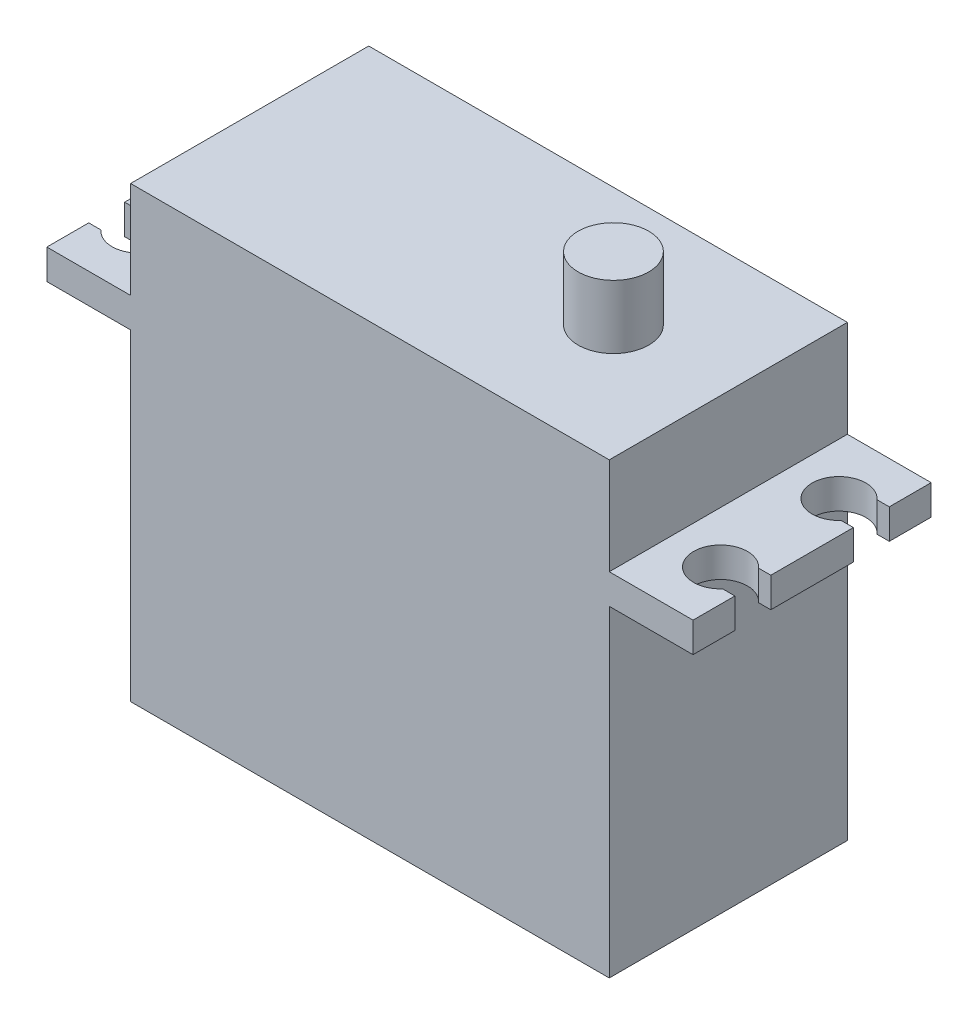
ISO-10303-21;
HEADER;
FILE_DESCRIPTION(('STEP AP214'),'2;1');
FILE_NAME('part.step','',(''),(''),'','','');
FILE_SCHEMA(('AUTOMOTIVE_DESIGN { 1 0 10303 214 1 1 1 1 }'));
ENDSEC;
DATA;
#1=APPLICATION_CONTEXT('core data for automotive mechanical design processes');
#2=APPLICATION_PROTOCOL_DEFINITION('international standard','automotive_design',2000,#1);
#3=PRODUCT_CONTEXT('',#1,'mechanical');
#4=PRODUCT('Part','Part','',(#3));
#5=PRODUCT_RELATED_PRODUCT_CATEGORY('part','',(#4));
#6=PRODUCT_DEFINITION_FORMATION('','',#4);
#7=PRODUCT_DEFINITION_CONTEXT('part definition',#1,'design');
#8=PRODUCT_DEFINITION('design','',#6,#7);
#9=PRODUCT_DEFINITION_SHAPE('','',#8);
#10=(LENGTH_UNIT() NAMED_UNIT(*) SI_UNIT(.MILLI.,.METRE.));
#11=(NAMED_UNIT(*) PLANE_ANGLE_UNIT() SI_UNIT($,.RADIAN.));
#12=(NAMED_UNIT(*) SI_UNIT($,.STERADIAN.) SOLID_ANGLE_UNIT());
#13=UNCERTAINTY_MEASURE_WITH_UNIT(LENGTH_MEASURE(1.E-05),#10,'distance_accuracy_value','');
#14=(GEOMETRIC_REPRESENTATION_CONTEXT(3) GLOBAL_UNCERTAINTY_ASSIGNED_CONTEXT((#13)) GLOBAL_UNIT_ASSIGNED_CONTEXT((#10,
#11,#12)) REPRESENTATION_CONTEXT('',''));
#15=CARTESIAN_POINT('',(0.,0.,0.));
#16=DIRECTION('',(0.,0.,1.));
#17=DIRECTION('',(1.,0.,0.));
#18=AXIS2_PLACEMENT_3D('',#15,#16,#17);
#19=CARTESIAN_POINT('',(10.4,42.8,0.));
#20=DIRECTION('',(0.,-1.,0.));
#21=DIRECTION('',(1.,0.,0.));
#22=AXIS2_PLACEMENT_3D('',#19,#20,#21);
#23=PLANE('',#22);
#24=CARTESIAN_POINT('',(10.4,42.8,0.));
#25=DIRECTION('',(0.,1.,0.));
#26=DIRECTION('',(-1.,0.,0.));
#27=AXIS2_PLACEMENT_3D('',#24,#25,#26);
#28=CIRCLE('',#27,2.95);
#29=CARTESIAN_POINT('',(7.45,42.8,0.));
#30=VERTEX_POINT('',#29);
#31=EDGE_CURVE('E11',#30,#30,#28,.T.);
#32=ORIENTED_EDGE('',*,*,#31,.T.);
#33=EDGE_LOOP('',(#32));
#34=FACE_BOUND('',#33,.T.);
#35=ADVANCED_FACE('F51',(#34),#23,.F.);
#36=CARTESIAN_POINT('',(10.4,42.8,0.));
#37=DIRECTION('',(0.,1.,0.));
#38=DIRECTION('',(-1.,0.,0.));
#39=AXIS2_PLACEMENT_3D('',#36,#37,#38);
#40=CYLINDRICAL_SURFACE('',#39,2.95);
#41=ORIENTED_EDGE('',*,*,#31,.F.);
#42=EDGE_LOOP('',(#41));
#43=FACE_BOUND('',#42,.T.);
#44=CARTESIAN_POINT('',(10.4,25.,0.));
#45=DIRECTION('',(0.,1.,0.));
#46=DIRECTION('',(-1.,0.,0.));
#47=AXIS2_PLACEMENT_3D('',#44,#45,#46);
#48=CIRCLE('',#47,2.95);
#49=CARTESIAN_POINT('',(7.45,25.,0.));
#50=VERTEX_POINT('',#49);
#51=EDGE_CURVE('E57',#50,#50,#48,.T.);
#52=ORIENTED_EDGE('',*,*,#51,.T.);
#53=EDGE_LOOP('',(#52));
#54=FACE_BOUND('',#53,.T.);
#55=ADVANCED_FACE('F83',(#43,#54),#40,.T.);
#56=CARTESIAN_POINT('',(13.35,25.,0.));
#57=DIRECTION('',(0.,-1.,0.));
#58=DIRECTION('',(1.,0.,0.));
#59=AXIS2_PLACEMENT_3D('',#56,#57,#58);
#60=PLANE('',#59);
#61=ORIENTED_EDGE('',*,*,#51,.F.);
#62=EDGE_LOOP('',(#61));
#63=FACE_BOUND('',#62,.T.);
#64=CARTESIAN_POINT('',(10.4,25.,0.));
#65=DIRECTION('',(0.,1.,0.));
#66=DIRECTION('',(-1.,0.,0.));
#67=AXIS2_PLACEMENT_3D('',#64,#65,#66);
#68=CIRCLE('',#67,6.);
#69=CARTESIAN_POINT('',(4.4,25.,0.));
#70=VERTEX_POINT('',#69);
#71=EDGE_CURVE('E61',#70,#70,#68,.T.);
#72=ORIENTED_EDGE('',*,*,#71,.T.);
#73=EDGE_LOOP('',(#72));
#74=FACE_BOUND('',#73,.T.);
#75=ADVANCED_FACE('F79',(#63,#74),#60,.F.);
#76=CARTESIAN_POINT('',(10.4,42.8,0.));
#77=DIRECTION('',(0.,1.,0.));
#78=DIRECTION('',(-1.,0.,0.));
#79=AXIS2_PLACEMENT_3D('',#76,#77,#78);
#80=CYLINDRICAL_SURFACE('',#79,6.);
#81=ORIENTED_EDGE('',*,*,#71,.F.);
#82=EDGE_LOOP('',(#81));
#83=FACE_BOUND('',#82,.T.);
#84=CARTESIAN_POINT('',(10.4,3.,0.));
#85=DIRECTION('',(0.,1.,0.));
#86=DIRECTION('',(-1.,0.,0.));
#87=AXIS2_PLACEMENT_3D('',#84,#85,#86);
#88=CIRCLE('',#87,6.);
#89=CARTESIAN_POINT('',(4.4,3.,0.));
#90=VERTEX_POINT('',#89);
#91=EDGE_CURVE('E65',#90,#90,#88,.T.);
#92=ORIENTED_EDGE('',*,*,#91,.T.);
#93=EDGE_LOOP('',(#92));
#94=FACE_BOUND('',#93,.T.);
#95=ADVANCED_FACE('F71',(#83,#94),#80,.T.);
#96=CARTESIAN_POINT('',(16.4,3.,0.));
#97=DIRECTION('',(0.,1.,0.));
#98=DIRECTION('',(-1.,0.,0.));
#99=AXIS2_PLACEMENT_3D('',#96,#97,#98);
#100=PLANE('',#99);
#101=ORIENTED_EDGE('',*,*,#91,.F.);
#102=EDGE_LOOP('',(#101));
#103=FACE_BOUND('',#102,.T.);
#104=ADVANCED_FACE('F73',(#103),#100,.F.);
#105=CLOSED_SHELL('',(#35,#55,#75,#95,#104));
#106=MANIFOLD_SOLID_BREP('B2',#105);
#107=CARTESIAN_POINT('',(-24.3,29.4,-4.95));
#108=DIRECTION('',(0.,1.,0.));
#109=DIRECTION('',(0.,0.,1.));
#110=AXIS2_PLACEMENT_3D('',#107,#108,#109);
#111=PLANE('',#110);
#112=DIRECTION('',(0.,0.,-1.));
#113=VECTOR('',#112,1.);
#114=CARTESIAN_POINT('',(20.,29.4,9.95));
#115=LINE('',#114,#113);
#116=CARTESIAN_POINT('',(20.,29.4,9.95));
#117=VERTEX_POINT('',#116);
#118=CARTESIAN_POINT('',(20.,29.4,-9.95));
#119=VERTEX_POINT('',#118);
#120=EDGE_CURVE('E128',#117,#119,#115,.T.);
#121=ORIENTED_EDGE('',*,*,#120,.F.);
#122=DIRECTION('',(1.,0.,0.));
#123=VECTOR('',#122,1.);
#124=CARTESIAN_POINT('',(-27.,29.4,9.95));
#125=LINE('',#124,#123);
#126=CARTESIAN_POINT('',(27.,29.4,9.95));
#127=VERTEX_POINT('',#126);
#128=EDGE_CURVE('E353',#117,#127,#125,.T.);
#129=ORIENTED_EDGE('',*,*,#128,.T.);
#130=DIRECTION('',(0.,0.,-1.));
#131=VECTOR('',#130,1.);
#132=CARTESIAN_POINT('',(27.,29.4,9.95));
#133=LINE('',#132,#131);
#134=CARTESIAN_POINT('',(27.,29.4,6.45));
#135=VERTEX_POINT('',#134);
#136=EDGE_CURVE('E356',#127,#135,#133,.T.);
#137=ORIENTED_EDGE('',*,*,#136,.T.);
#138=DIRECTION('',(-1.,0.,0.));
#139=VECTOR('',#138,1.);
#140=CARTESIAN_POINT('',(25.9770509831248,29.4,6.45));
#141=LINE('',#140,#139);
#142=CARTESIAN_POINT('',(25.9770509831248,29.4,6.45));
#143=VERTEX_POINT('',#142);
#144=EDGE_CURVE('E358',#135,#143,#141,.T.);
#145=ORIENTED_EDGE('',*,*,#144,.T.);
#146=CARTESIAN_POINT('',(24.3,29.4,4.95));
#147=DIRECTION('',(0.,-1.,0.));
#148=DIRECTION('',(0.,0.,1.));
#149=AXIS2_PLACEMENT_3D('',#146,#147,#148);
#150=CIRCLE('',#149,2.25);
#151=CARTESIAN_POINT('',(25.9770509831248,29.4,3.45));
#152=VERTEX_POINT('',#151);
#153=EDGE_CURVE('E360',#143,#152,#150,.T.);
#154=ORIENTED_EDGE('',*,*,#153,.T.);
#155=DIRECTION('',(1.,0.,0.));
#156=VECTOR('',#155,1.);
#157=CARTESIAN_POINT('',(25.9770509831248,29.4,3.45));
#158=LINE('',#157,#156);
#159=CARTESIAN_POINT('',(27.,29.4,3.45));
#160=VERTEX_POINT('',#159);
#161=EDGE_CURVE('E362',#152,#160,#158,.T.);
#162=ORIENTED_EDGE('',*,*,#161,.T.);
#163=DIRECTION('',(0.,0.,-1.));
#164=VECTOR('',#163,1.);
#165=CARTESIAN_POINT('',(27.,29.4,3.45));
#166=LINE('',#165,#164);
#167=CARTESIAN_POINT('',(27.,29.4,-3.45));
#168=VERTEX_POINT('',#167);
#169=EDGE_CURVE('E364',#160,#168,#166,.T.);
#170=ORIENTED_EDGE('',*,*,#169,.T.);
#171=DIRECTION('',(-1.,0.,0.));
#172=VECTOR('',#171,1.);
#173=CARTESIAN_POINT('',(25.9770509831248,29.4,-3.45));
#174=LINE('',#173,#172);
#175=CARTESIAN_POINT('',(25.9770509831248,29.4,-3.45));
#176=VERTEX_POINT('',#175);
#177=EDGE_CURVE('E366',#168,#176,#174,.T.);
#178=ORIENTED_EDGE('',*,*,#177,.T.);
#179=CARTESIAN_POINT('',(24.3,29.4,-4.95));
#180=DIRECTION('',(0.,-1.,0.));
#181=DIRECTION('',(0.,0.,1.));
#182=AXIS2_PLACEMENT_3D('',#179,#180,#181);
#183=CIRCLE('',#182,2.25);
#184=CARTESIAN_POINT('',(25.9770509831248,29.4,-6.45));
#185=VERTEX_POINT('',#184);
#186=EDGE_CURVE('E368',#176,#185,#183,.T.);
#187=ORIENTED_EDGE('',*,*,#186,.T.);
#188=DIRECTION('',(1.,0.,0.));
#189=VECTOR('',#188,1.);
#190=CARTESIAN_POINT('',(25.9770509831248,29.4,-6.45));
#191=LINE('',#190,#189);
#192=CARTESIAN_POINT('',(27.,29.4,-6.45));
#193=VERTEX_POINT('',#192);
#194=EDGE_CURVE('E370',#185,#193,#191,.T.);
#195=ORIENTED_EDGE('',*,*,#194,.T.);
#196=DIRECTION('',(0.,0.,-1.));
#197=VECTOR('',#196,1.);
#198=CARTESIAN_POINT('',(27.,29.4,-6.45));
#199=LINE('',#198,#197);
#200=CARTESIAN_POINT('',(27.,29.4,-9.95));
#201=VERTEX_POINT('',#200);
#202=EDGE_CURVE('E328',#193,#201,#199,.T.);
#203=ORIENTED_EDGE('',*,*,#202,.T.);
#204=DIRECTION('',(-1.,0.,0.));
#205=VECTOR('',#204,1.);
#206=CARTESIAN_POINT('',(-27.,29.4,-9.95));
#207=LINE('',#206,#205);
#208=EDGE_CURVE('E333',#201,#119,#207,.T.);
#209=ORIENTED_EDGE('',*,*,#208,.T.);
#210=EDGE_LOOP('',(#121,#129,#137,#145,#154,#162,#170,#178,#187,#195,#203,#209));
#211=FACE_BOUND('',#210,.T.);
#212=ADVANCED_FACE('F112',(#211),#111,.T.);
#213=CARTESIAN_POINT('',(20.,26.9,9.95));
#214=DIRECTION('',(-1.,0.,0.));
#215=DIRECTION('',(0.,0.,1.));
#216=AXIS2_PLACEMENT_3D('',#213,#214,#215);
#217=PLANE('',#216);
#218=DIRECTION('',(0.,0.,-1.));
#219=VECTOR('',#218,1.);
#220=CARTESIAN_POINT('',(20.,0.,9.95));
#221=LINE('',#220,#219);
#222=CARTESIAN_POINT('',(20.,0.,9.95));
#223=VERTEX_POINT('',#222);
#224=CARTESIAN_POINT('',(20.,0.,-9.95));
#225=VERTEX_POINT('',#224);
#226=EDGE_CURVE('E472',#223,#225,#221,.T.);
#227=ORIENTED_EDGE('',*,*,#226,.T.);
#228=DIRECTION('',(0.,-1.,0.));
#229=VECTOR('',#228,1.);
#230=CARTESIAN_POINT('',(20.,26.9,-9.95));
#231=LINE('',#230,#229);
#232=CARTESIAN_POINT('',(20.,26.9,-9.95));
#233=VERTEX_POINT('',#232);
#234=EDGE_CURVE('E49',#233,#225,#231,.T.);
#235=ORIENTED_EDGE('',*,*,#234,.F.);
#236=DIRECTION('',(0.,0.,-1.));
#237=VECTOR('',#236,1.);
#238=CARTESIAN_POINT('',(20.,26.9,9.95));
#239=LINE('',#238,#237);
#240=CARTESIAN_POINT('',(20.,26.9,9.95));
#241=VERTEX_POINT('',#240);
#242=EDGE_CURVE('E473',#241,#233,#239,.T.);
#243=ORIENTED_EDGE('',*,*,#242,.F.);
#244=DIRECTION('',(0.,-1.,0.));
#245=VECTOR('',#244,1.);
#246=CARTESIAN_POINT('',(20.,26.9,9.95));
#247=LINE('',#246,#245);
#248=EDGE_CURVE('E480',#241,#223,#247,.T.);
#249=ORIENTED_EDGE('',*,*,#248,.T.);
#250=EDGE_LOOP('',(#227,#235,#243,#249));
#251=FACE_BOUND('',#250,.T.);
#252=ADVANCED_FACE('F114',(#251),#217,.F.);
#253=CARTESIAN_POINT('',(-20.,26.9,-9.95));
#254=DIRECTION('',(0.,0.,1.));
#255=DIRECTION('',(1.,0.,0.));
#256=AXIS2_PLACEMENT_3D('',#253,#254,#255);
#257=PLANE('',#256);
#258=DIRECTION('',(-1.,0.,0.));
#259=VECTOR('',#258,1.);
#260=CARTESIAN_POINT('',(-20.,0.,-9.95));
#261=LINE('',#260,#259);
#262=CARTESIAN_POINT('',(-20.,0.,-9.95));
#263=VERTEX_POINT('',#262);
#264=EDGE_CURVE('E483',#225,#263,#261,.T.);
#265=ORIENTED_EDGE('',*,*,#264,.T.);
#266=DIRECTION('',(0.,-1.,0.));
#267=VECTOR('',#266,1.);
#268=CARTESIAN_POINT('',(-20.,26.9,-9.95));
#269=LINE('',#268,#267);
#270=CARTESIAN_POINT('',(-20.,26.9,-9.95));
#271=VERTEX_POINT('',#270);
#272=EDGE_CURVE('E121',#271,#263,#269,.T.);
#273=ORIENTED_EDGE('',*,*,#272,.F.);
#274=DIRECTION('',(-1.,0.,0.));
#275=VECTOR('',#274,1.);
#276=CARTESIAN_POINT('',(-27.,26.9,-9.95));
#277=LINE('',#276,#275);
#278=CARTESIAN_POINT('',(-27.,26.9,-9.95));
#279=VERTEX_POINT('',#278);
#280=EDGE_CURVE('E322',#271,#279,#277,.T.);
#281=ORIENTED_EDGE('',*,*,#280,.T.);
#282=DIRECTION('',(0.,-1.,0.));
#283=VECTOR('',#282,1.);
#284=CARTESIAN_POINT('',(-27.,29.4,-9.95));
#285=LINE('',#284,#283);
#286=CARTESIAN_POINT('',(-27.,29.4,-9.95));
#287=VERTEX_POINT('',#286);
#288=EDGE_CURVE('E466',#287,#279,#285,.T.);
#289=ORIENTED_EDGE('',*,*,#288,.F.);
#290=CARTESIAN_POINT('',(-20.,29.4,-9.95));
#291=VERTEX_POINT('',#290);
#292=EDGE_CURVE('E331',#291,#287,#207,.T.);
#293=ORIENTED_EDGE('',*,*,#292,.F.);
#294=DIRECTION('',(0.,-1.,0.));
#295=VECTOR('',#294,1.);
#296=CARTESIAN_POINT('',(-20.,37.5,-9.95));
#297=LINE('',#296,#295);
#298=CARTESIAN_POINT('',(-20.,37.5,-9.95));
#299=VERTEX_POINT('',#298);
#300=EDGE_CURVE('E304',#299,#291,#297,.T.);
#301=ORIENTED_EDGE('',*,*,#300,.F.);
#302=DIRECTION('',(-1.,0.,0.));
#303=VECTOR('',#302,1.);
#304=CARTESIAN_POINT('',(-20.,37.5,-9.95));
#305=LINE('',#304,#303);
#306=CARTESIAN_POINT('',(20.,37.5,-9.95));
#307=VERTEX_POINT('',#306);
#308=EDGE_CURVE('E298',#307,#299,#305,.T.);
#309=ORIENTED_EDGE('',*,*,#308,.F.);
#310=DIRECTION('',(0.,-1.,0.));
#311=VECTOR('',#310,1.);
#312=CARTESIAN_POINT('',(20.,37.5,-9.95));
#313=LINE('',#312,#311);
#314=EDGE_CURVE('E302',#307,#119,#313,.T.);
#315=ORIENTED_EDGE('',*,*,#314,.T.);
#316=ORIENTED_EDGE('',*,*,#208,.F.);
#317=DIRECTION('',(0.,-1.,0.));
#318=VECTOR('',#317,1.);
#319=CARTESIAN_POINT('',(27.,29.4,-9.95));
#320=LINE('',#319,#318);
#321=CARTESIAN_POINT('',(27.,26.9,-9.95));
#322=VERTEX_POINT('',#321);
#323=EDGE_CURVE('E469',#201,#322,#320,.T.);
#324=ORIENTED_EDGE('',*,*,#323,.T.);
#325=EDGE_CURVE('E373',#322,#233,#277,.T.);
#326=ORIENTED_EDGE('',*,*,#325,.T.);
#327=ORIENTED_EDGE('',*,*,#234,.T.);
#328=EDGE_LOOP('',(#265,#273,#281,#289,#293,#301,#309,#315,#316,#324,#326,#327));
#329=FACE_BOUND('',#328,.T.);
#330=ADVANCED_FACE('F300',(#329),#257,.F.);
#331=CARTESIAN_POINT('',(-20.,26.9,9.95));
#332=DIRECTION('',(1.,0.,0.));
#333=DIRECTION('',(0.,0.,-1.));
#334=AXIS2_PLACEMENT_3D('',#331,#332,#333);
#335=PLANE('',#334);
#336=DIRECTION('',(0.,0.,1.));
#337=VECTOR('',#336,1.);
#338=CARTESIAN_POINT('',(-20.,0.,9.95));
#339=LINE('',#338,#337);
#340=CARTESIAN_POINT('',(-20.,0.,9.95));
#341=VERTEX_POINT('',#340);
#342=EDGE_CURVE('E485',#263,#341,#339,.T.);
#343=ORIENTED_EDGE('',*,*,#342,.T.);
#344=DIRECTION('',(0.,-1.,0.));
#345=VECTOR('',#344,1.);
#346=CARTESIAN_POINT('',(-20.,26.9,9.95));
#347=LINE('',#346,#345);
#348=CARTESIAN_POINT('',(-20.,26.9,9.95));
#349=VERTEX_POINT('',#348);
#350=EDGE_CURVE('E490',#349,#341,#347,.T.);
#351=ORIENTED_EDGE('',*,*,#350,.F.);
#352=DIRECTION('',(0.,0.,1.));
#353=VECTOR('',#352,1.);
#354=CARTESIAN_POINT('',(-20.,26.9,9.95));
#355=LINE('',#354,#353);
#356=EDGE_CURVE('E476',#271,#349,#355,.T.);
#357=ORIENTED_EDGE('',*,*,#356,.F.);
#358=ORIENTED_EDGE('',*,*,#272,.T.);
#359=EDGE_LOOP('',(#343,#351,#357,#358));
#360=FACE_BOUND('',#359,.T.);
#361=ADVANCED_FACE('F497',(#360),#335,.F.);
#362=CARTESIAN_POINT('',(-20.,26.9,9.95));
#363=DIRECTION('',(0.,0.,-1.));
#364=DIRECTION('',(-1.,0.,0.));
#365=AXIS2_PLACEMENT_3D('',#362,#363,#364);
#366=PLANE('',#365);
#367=DIRECTION('',(1.,0.,0.));
#368=VECTOR('',#367,1.);
#369=CARTESIAN_POINT('',(-20.,0.,9.95));
#370=LINE('',#369,#368);
#371=EDGE_CURVE('E477',#341,#223,#370,.T.);
#372=ORIENTED_EDGE('',*,*,#371,.T.);
#373=ORIENTED_EDGE('',*,*,#248,.F.);
#374=DIRECTION('',(1.,0.,0.));
#375=VECTOR('',#374,1.);
#376=CARTESIAN_POINT('',(-27.,26.9,9.95));
#377=LINE('',#376,#375);
#378=CARTESIAN_POINT('',(27.,26.9,9.95));
#379=VERTEX_POINT('',#378);
#380=EDGE_CURVE('E394',#241,#379,#377,.T.);
#381=ORIENTED_EDGE('',*,*,#380,.T.);
#382=DIRECTION('',(0.,-1.,0.));
#383=VECTOR('',#382,1.);
#384=CARTESIAN_POINT('',(27.,29.4,9.95));
#385=LINE('',#384,#383);
#386=EDGE_CURVE('E436',#127,#379,#385,.T.);
#387=ORIENTED_EDGE('',*,*,#386,.F.);
#388=ORIENTED_EDGE('',*,*,#128,.F.);
#389=DIRECTION('',(0.,-1.,0.));
#390=VECTOR('',#389,1.);
#391=CARTESIAN_POINT('',(20.,37.5,9.95));
#392=LINE('',#391,#390);
#393=CARTESIAN_POINT('',(20.,37.5,9.95));
#394=VERTEX_POINT('',#393);
#395=EDGE_CURVE('E519',#394,#117,#392,.T.);
#396=ORIENTED_EDGE('',*,*,#395,.F.);
#397=DIRECTION('',(1.,0.,0.));
#398=VECTOR('',#397,1.);
#399=CARTESIAN_POINT('',(-20.,37.5,9.95));
#400=LINE('',#399,#398);
#401=CARTESIAN_POINT('',(-20.,37.5,9.95));
#402=VERTEX_POINT('',#401);
#403=EDGE_CURVE('E313',#402,#394,#400,.T.);
#404=ORIENTED_EDGE('',*,*,#403,.F.);
#405=DIRECTION('',(0.,-1.,0.));
#406=VECTOR('',#405,1.);
#407=CARTESIAN_POINT('',(-20.,37.5,9.95));
#408=LINE('',#407,#406);
#409=CARTESIAN_POINT('',(-20.,29.4,9.95));
#410=VERTEX_POINT('',#409);
#411=EDGE_CURVE('E324',#402,#410,#408,.T.);
#412=ORIENTED_EDGE('',*,*,#411,.T.);
#413=CARTESIAN_POINT('',(-27.,29.4,9.95));
#414=VERTEX_POINT('',#413);
#415=EDGE_CURVE('E354',#414,#410,#125,.T.);
#416=ORIENTED_EDGE('',*,*,#415,.F.);
#417=DIRECTION('',(0.,-1.,0.));
#418=VECTOR('',#417,1.);
#419=CARTESIAN_POINT('',(-27.,29.4,9.95));
#420=LINE('',#419,#418);
#421=CARTESIAN_POINT('',(-27.,26.9,9.95));
#422=VERTEX_POINT('',#421);
#423=EDGE_CURVE('E439',#414,#422,#420,.T.);
#424=ORIENTED_EDGE('',*,*,#423,.T.);
#425=EDGE_CURVE('E395',#422,#349,#377,.T.);
#426=ORIENTED_EDGE('',*,*,#425,.T.);
#427=ORIENTED_EDGE('',*,*,#350,.T.);
#428=EDGE_LOOP('',(#372,#373,#381,#387,#388,#396,#404,#412,#416,#424,#426,#427));
#429=FACE_BOUND('',#428,.T.);
#430=ADVANCED_FACE('F504',(#429),#366,.F.);
#431=CARTESIAN_POINT('',(0.,0.,0.));
#432=DIRECTION('',(0.,-1.,0.));
#433=DIRECTION('',(0.,0.,-1.));
#434=AXIS2_PLACEMENT_3D('',#431,#432,#433);
#435=PLANE('',#434);
#436=ORIENTED_EDGE('',*,*,#226,.F.);
#437=ORIENTED_EDGE('',*,*,#371,.F.);
#438=ORIENTED_EDGE('',*,*,#342,.F.);
#439=ORIENTED_EDGE('',*,*,#264,.F.);
#440=EDGE_LOOP('',(#436,#437,#438,#439));
#441=FACE_BOUND('',#440,.T.);
#442=ADVANCED_FACE('F502',(#441),#435,.T.);
#443=CARTESIAN_POINT('',(-24.3,26.9,-4.95));
#444=DIRECTION('',(0.,1.,0.));
#445=DIRECTION('',(0.,0.,1.));
#446=AXIS2_PLACEMENT_3D('',#443,#444,#445);
#447=PLANE('',#446);
#448=ORIENTED_EDGE('',*,*,#380,.F.);
#449=ORIENTED_EDGE('',*,*,#242,.T.);
#450=ORIENTED_EDGE('',*,*,#325,.F.);
#451=DIRECTION('',(0.,0.,-1.));
#452=VECTOR('',#451,1.);
#453=CARTESIAN_POINT('',(27.,26.9,-6.45));
#454=LINE('',#453,#452);
#455=CARTESIAN_POINT('',(27.,26.9,-6.45));
#456=VERTEX_POINT('',#455);
#457=EDGE_CURVE('E319',#456,#322,#454,.T.);
#458=ORIENTED_EDGE('',*,*,#457,.F.);
#459=DIRECTION('',(1.,0.,0.));
#460=VECTOR('',#459,1.);
#461=CARTESIAN_POINT('',(25.9770509831248,26.9,-6.45));
#462=LINE('',#461,#460);
#463=CARTESIAN_POINT('',(25.9770509831248,26.9,-6.45));
#464=VERTEX_POINT('',#463);
#465=EDGE_CURVE('E332',#464,#456,#462,.T.);
#466=ORIENTED_EDGE('',*,*,#465,.F.);
#467=CARTESIAN_POINT('',(24.3,26.9,-4.95));
#468=DIRECTION('',(0.,-1.,0.));
#469=DIRECTION('',(0.,0.,1.));
#470=AXIS2_PLACEMENT_3D('',#467,#468,#469);
#471=CIRCLE('',#470,2.25);
#472=CARTESIAN_POINT('',(25.9770509831248,26.9,-3.45));
#473=VERTEX_POINT('',#472);
#474=EDGE_CURVE('E410',#473,#464,#471,.T.);
#475=ORIENTED_EDGE('',*,*,#474,.F.);
#476=DIRECTION('',(-1.,0.,0.));
#477=VECTOR('',#476,1.);
#478=CARTESIAN_POINT('',(25.9770509831248,26.9,-3.45));
#479=LINE('',#478,#477);
#480=CARTESIAN_POINT('',(27.,26.9,-3.45));
#481=VERTEX_POINT('',#480);
#482=EDGE_CURVE('E408',#481,#473,#479,.T.);
#483=ORIENTED_EDGE('',*,*,#482,.F.);
#484=DIRECTION('',(0.,0.,-1.));
#485=VECTOR('',#484,1.);
#486=CARTESIAN_POINT('',(27.,26.9,3.45));
#487=LINE('',#486,#485);
#488=CARTESIAN_POINT('',(27.,26.9,3.45));
#489=VERTEX_POINT('',#488);
#490=EDGE_CURVE('E406',#489,#481,#487,.T.);
#491=ORIENTED_EDGE('',*,*,#490,.F.);
#492=DIRECTION('',(1.,0.,0.));
#493=VECTOR('',#492,1.);
#494=CARTESIAN_POINT('',(25.9770509831248,26.9,3.45));
#495=LINE('',#494,#493);
#496=CARTESIAN_POINT('',(25.9770509831248,26.9,3.45));
#497=VERTEX_POINT('',#496);
#498=EDGE_CURVE('E404',#497,#489,#495,.T.);
#499=ORIENTED_EDGE('',*,*,#498,.F.);
#500=CARTESIAN_POINT('',(24.3,26.9,4.95));
#501=DIRECTION('',(0.,-1.,0.));
#502=DIRECTION('',(0.,0.,1.));
#503=AXIS2_PLACEMENT_3D('',#500,#501,#502);
#504=CIRCLE('',#503,2.25);
#505=CARTESIAN_POINT('',(25.9770509831248,26.9,6.45));
#506=VERTEX_POINT('',#505);
#507=EDGE_CURVE('E402',#506,#497,#504,.T.);
#508=ORIENTED_EDGE('',*,*,#507,.F.);
#509=DIRECTION('',(-1.,0.,0.));
#510=VECTOR('',#509,1.);
#511=CARTESIAN_POINT('',(25.9770509831248,26.9,6.45));
#512=LINE('',#511,#510);
#513=CARTESIAN_POINT('',(27.,26.9,6.45));
#514=VERTEX_POINT('',#513);
#515=EDGE_CURVE('E400',#514,#506,#512,.T.);
#516=ORIENTED_EDGE('',*,*,#515,.F.);
#517=DIRECTION('',(0.,0.,-1.));
#518=VECTOR('',#517,1.);
#519=CARTESIAN_POINT('',(27.,26.9,9.95));
#520=LINE('',#519,#518);
#521=EDGE_CURVE('E398',#379,#514,#520,.T.);
#522=ORIENTED_EDGE('',*,*,#521,.F.);
#523=EDGE_LOOP('',(#448,#449,#450,#458,#466,#475,#483,#491,#499,#508,#516,#522));
#524=FACE_BOUND('',#523,.T.);
#525=ADVANCED_FACE('F510',(#524),#447,.F.);
#526=ORIENTED_EDGE('',*,*,#280,.F.);
#527=ORIENTED_EDGE('',*,*,#356,.T.);
#528=ORIENTED_EDGE('',*,*,#425,.F.);
#529=DIRECTION('',(0.,0.,1.));
#530=VECTOR('',#529,1.);
#531=CARTESIAN_POINT('',(-27.,26.9,9.95));
#532=LINE('',#531,#530);
#533=CARTESIAN_POINT('',(-27.,26.9,6.45));
#534=VERTEX_POINT('',#533);
#535=EDGE_CURVE('E392',#534,#422,#532,.T.);
#536=ORIENTED_EDGE('',*,*,#535,.F.);
#537=DIRECTION('',(-1.,0.,0.));
#538=VECTOR('',#537,1.);
#539=CARTESIAN_POINT('',(-25.9770509831249,26.9,6.45));
#540=LINE('',#539,#538);
#541=CARTESIAN_POINT('',(-25.9770509831249,26.9,6.45));
#542=VERTEX_POINT('',#541);
#543=EDGE_CURVE('E390',#542,#534,#540,.T.);
#544=ORIENTED_EDGE('',*,*,#543,.F.);
#545=CARTESIAN_POINT('',(-24.3,26.9,4.95));
#546=DIRECTION('',(0.,-1.,0.));
#547=DIRECTION('',(0.,0.,1.));
#548=AXIS2_PLACEMENT_3D('',#545,#546,#547);
#549=CIRCLE('',#548,2.25);
#550=CARTESIAN_POINT('',(-25.9770509831249,26.9,3.45));
#551=VERTEX_POINT('',#550);
#552=EDGE_CURVE('E388',#551,#542,#549,.T.);
#553=ORIENTED_EDGE('',*,*,#552,.F.);
#554=DIRECTION('',(1.,0.,0.));
#555=VECTOR('',#554,1.);
#556=CARTESIAN_POINT('',(-25.9770509831249,26.9,3.45));
#557=LINE('',#556,#555);
#558=CARTESIAN_POINT('',(-27.,26.9,3.45));
#559=VERTEX_POINT('',#558);
#560=EDGE_CURVE('E386',#559,#551,#557,.T.);
#561=ORIENTED_EDGE('',*,*,#560,.F.);
#562=DIRECTION('',(0.,0.,1.));
#563=VECTOR('',#562,1.);
#564=CARTESIAN_POINT('',(-27.,26.9,3.45));
#565=LINE('',#564,#563);
#566=CARTESIAN_POINT('',(-27.,26.9,-3.45000000000001));
#567=VERTEX_POINT('',#566);
#568=EDGE_CURVE('E384',#567,#559,#565,.T.);
#569=ORIENTED_EDGE('',*,*,#568,.F.);
#570=DIRECTION('',(-1.,0.,0.));
#571=VECTOR('',#570,1.);
#572=CARTESIAN_POINT('',(-25.9770509831249,26.9,-3.45000000000001));
#573=LINE('',#572,#571);
#574=CARTESIAN_POINT('',(-25.9770509831249,26.9,-3.45000000000001));
#575=VERTEX_POINT('',#574);
#576=EDGE_CURVE('E382',#575,#567,#573,.T.);
#577=ORIENTED_EDGE('',*,*,#576,.F.);
#578=CARTESIAN_POINT('',(-24.3,26.9,-4.95));
#579=DIRECTION('',(0.,-1.,0.));
#580=DIRECTION('',(0.,0.,1.));
#581=AXIS2_PLACEMENT_3D('',#578,#579,#580);
#582=CIRCLE('',#581,2.25);
#583=CARTESIAN_POINT('',(-25.9770509831249,26.9,-6.45));
#584=VERTEX_POINT('',#583);
#585=EDGE_CURVE('E380',#584,#575,#582,.T.);
#586=ORIENTED_EDGE('',*,*,#585,.F.);
#587=DIRECTION('',(1.,0.,0.));
#588=VECTOR('',#587,1.);
#589=CARTESIAN_POINT('',(-25.9770509831249,26.9,-6.45));
#590=LINE('',#589,#588);
#591=CARTESIAN_POINT('',(-27.,26.9,-6.45));
#592=VERTEX_POINT('',#591);
#593=EDGE_CURVE('E378',#592,#584,#590,.T.);
#594=ORIENTED_EDGE('',*,*,#593,.F.);
#595=DIRECTION('',(0.,0.,1.));
#596=VECTOR('',#595,1.);
#597=CARTESIAN_POINT('',(-27.,26.9,-6.45));
#598=LINE('',#597,#596);
#599=EDGE_CURVE('E376',#279,#592,#598,.T.);
#600=ORIENTED_EDGE('',*,*,#599,.F.);
#601=EDGE_LOOP('',(#526,#527,#528,#536,#544,#553,#561,#569,#577,#586,#594,#600));
#602=FACE_BOUND('',#601,.T.);
#603=ADVANCED_FACE('F639',(#602),#447,.F.);
#604=CARTESIAN_POINT('',(27.,29.4,-6.45));
#605=DIRECTION('',(-1.,0.,0.));
#606=DIRECTION('',(0.,0.,1.));
#607=AXIS2_PLACEMENT_3D('',#604,#605,#606);
#608=PLANE('',#607);
#609=ORIENTED_EDGE('',*,*,#457,.T.);
#610=ORIENTED_EDGE('',*,*,#323,.F.);
#611=ORIENTED_EDGE('',*,*,#202,.F.);
#612=DIRECTION('',(0.,-1.,0.));
#613=VECTOR('',#612,1.);
#614=CARTESIAN_POINT('',(27.,29.4,-6.45));
#615=LINE('',#614,#613);
#616=EDGE_CURVE('E371',#193,#456,#615,.T.);
#617=ORIENTED_EDGE('',*,*,#616,.T.);
#618=EDGE_LOOP('',(#609,#610,#611,#617));
#619=FACE_BOUND('',#618,.T.);
#620=ADVANCED_FACE('F635',(#619),#608,.F.);
#621=CARTESIAN_POINT('',(-27.,29.4,-6.45));
#622=DIRECTION('',(1.,0.,0.));
#623=DIRECTION('',(0.,0.,-1.));
#624=AXIS2_PLACEMENT_3D('',#621,#622,#623);
#625=PLANE('',#624);
#626=ORIENTED_EDGE('',*,*,#599,.T.);
#627=DIRECTION('',(0.,-1.,0.));
#628=VECTOR('',#627,1.);
#629=CARTESIAN_POINT('',(-27.,29.4,-6.45));
#630=LINE('',#629,#628);
#631=CARTESIAN_POINT('',(-27.,29.4,-6.45));
#632=VERTEX_POINT('',#631);
#633=EDGE_CURVE('E463',#632,#592,#630,.T.);
#634=ORIENTED_EDGE('',*,*,#633,.F.);
#635=DIRECTION('',(0.,0.,1.));
#636=VECTOR('',#635,1.);
#637=CARTESIAN_POINT('',(-27.,29.4,-6.45));
#638=LINE('',#637,#636);
#639=EDGE_CURVE('E335',#287,#632,#638,.T.);
#640=ORIENTED_EDGE('',*,*,#639,.F.);
#641=ORIENTED_EDGE('',*,*,#288,.T.);
#642=EDGE_LOOP('',(#626,#634,#640,#641));
#643=FACE_BOUND('',#642,.T.);
#644=ADVANCED_FACE('F631',(#643),#625,.F.);
#645=CARTESIAN_POINT('',(-25.9770509831249,29.4,-6.45));
#646=DIRECTION('',(0.,0.,-1.));
#647=DIRECTION('',(-1.,0.,0.));
#648=AXIS2_PLACEMENT_3D('',#645,#646,#647);
#649=PLANE('',#648);
#650=ORIENTED_EDGE('',*,*,#593,.T.);
#651=DIRECTION('',(0.,-1.,0.));
#652=VECTOR('',#651,1.);
#653=CARTESIAN_POINT('',(-25.9770509831249,29.4,-6.45));
#654=LINE('',#653,#652);
#655=CARTESIAN_POINT('',(-25.9770509831249,29.4,-6.45));
#656=VERTEX_POINT('',#655);
#657=EDGE_CURVE('E460',#656,#584,#654,.T.);
#658=ORIENTED_EDGE('',*,*,#657,.F.);
#659=DIRECTION('',(1.,0.,0.));
#660=VECTOR('',#659,1.);
#661=CARTESIAN_POINT('',(-25.9770509831249,29.4,-6.45));
#662=LINE('',#661,#660);
#663=EDGE_CURVE('E337',#632,#656,#662,.T.);
#664=ORIENTED_EDGE('',*,*,#663,.F.);
#665=ORIENTED_EDGE('',*,*,#633,.T.);
#666=EDGE_LOOP('',(#650,#658,#664,#665));
#667=FACE_BOUND('',#666,.T.);
#668=ADVANCED_FACE('F627',(#667),#649,.F.);
#669=CARTESIAN_POINT('',(-24.3,29.4,-4.95));
#670=DIRECTION('',(0.,-1.,0.));
#671=DIRECTION('',(0.,0.,-1.));
#672=AXIS2_PLACEMENT_3D('',#669,#670,#671);
#673=CYLINDRICAL_SURFACE('',#672,2.25);
#674=ORIENTED_EDGE('',*,*,#585,.T.);
#675=DIRECTION('',(0.,-1.,0.));
#676=VECTOR('',#675,1.);
#677=CARTESIAN_POINT('',(-25.9770509831249,29.4,-3.45000000000001));
#678=LINE('',#677,#676);
#679=CARTESIAN_POINT('',(-25.9770509831249,29.4,-3.45000000000001));
#680=VERTEX_POINT('',#679);
#681=EDGE_CURVE('E457',#680,#575,#678,.T.);
#682=ORIENTED_EDGE('',*,*,#681,.F.);
#683=CARTESIAN_POINT('',(-24.3,29.4,-4.95));
#684=DIRECTION('',(0.,-1.,0.));
#685=DIRECTION('',(0.,0.,1.));
#686=AXIS2_PLACEMENT_3D('',#683,#684,#685);
#687=CIRCLE('',#686,2.25);
#688=EDGE_CURVE('E339',#656,#680,#687,.T.);
#689=ORIENTED_EDGE('',*,*,#688,.F.);
#690=ORIENTED_EDGE('',*,*,#657,.T.);
#691=EDGE_LOOP('',(#674,#682,#689,#690));
#692=FACE_BOUND('',#691,.T.);
#693=ADVANCED_FACE('F623',(#692),#673,.F.);
#694=CARTESIAN_POINT('',(-25.9770509831249,29.4,-3.45000000000001));
#695=DIRECTION('',(0.,0.,1.));
#696=DIRECTION('',(1.,0.,0.));
#697=AXIS2_PLACEMENT_3D('',#694,#695,#696);
#698=PLANE('',#697);
#699=ORIENTED_EDGE('',*,*,#576,.T.);
#700=DIRECTION('',(0.,-1.,0.));
#701=VECTOR('',#700,1.);
#702=CARTESIAN_POINT('',(-27.,29.4,-3.45000000000001));
#703=LINE('',#702,#701);
#704=CARTESIAN_POINT('',(-27.,29.4,-3.45000000000001));
#705=VERTEX_POINT('',#704);
#706=EDGE_CURVE('E454',#705,#567,#703,.T.);
#707=ORIENTED_EDGE('',*,*,#706,.F.);
#708=DIRECTION('',(-1.,0.,0.));
#709=VECTOR('',#708,1.);
#710=CARTESIAN_POINT('',(-25.9770509831249,29.4,-3.45000000000001));
#711=LINE('',#710,#709);
#712=EDGE_CURVE('E341',#680,#705,#711,.T.);
#713=ORIENTED_EDGE('',*,*,#712,.F.);
#714=ORIENTED_EDGE('',*,*,#681,.T.);
#715=EDGE_LOOP('',(#699,#707,#713,#714));
#716=FACE_BOUND('',#715,.T.);
#717=ADVANCED_FACE('F619',(#716),#698,.F.);
#718=CARTESIAN_POINT('',(-27.,29.4,3.45));
#719=DIRECTION('',(1.,0.,0.));
#720=DIRECTION('',(0.,0.,-1.));
#721=AXIS2_PLACEMENT_3D('',#718,#719,#720);
#722=PLANE('',#721);
#723=ORIENTED_EDGE('',*,*,#568,.T.);
#724=DIRECTION('',(0.,-1.,0.));
#725=VECTOR('',#724,1.);
#726=CARTESIAN_POINT('',(-27.,29.4,3.45));
#727=LINE('',#726,#725);
#728=CARTESIAN_POINT('',(-27.,29.4,3.45));
#729=VERTEX_POINT('',#728);
#730=EDGE_CURVE('E451',#729,#559,#727,.T.);
#731=ORIENTED_EDGE('',*,*,#730,.F.);
#732=DIRECTION('',(0.,0.,1.));
#733=VECTOR('',#732,1.);
#734=CARTESIAN_POINT('',(-27.,29.4,3.45));
#735=LINE('',#734,#733);
#736=EDGE_CURVE('E343',#705,#729,#735,.T.);
#737=ORIENTED_EDGE('',*,*,#736,.F.);
#738=ORIENTED_EDGE('',*,*,#706,.T.);
#739=EDGE_LOOP('',(#723,#731,#737,#738));
#740=FACE_BOUND('',#739,.T.);
#741=ADVANCED_FACE('F615',(#740),#722,.F.);
#742=CARTESIAN_POINT('',(-25.9770509831249,29.4,3.45));
#743=DIRECTION('',(0.,0.,-1.));
#744=DIRECTION('',(-1.,0.,0.));
#745=AXIS2_PLACEMENT_3D('',#742,#743,#744);
#746=PLANE('',#745);
#747=ORIENTED_EDGE('',*,*,#560,.T.);
#748=DIRECTION('',(0.,-1.,0.));
#749=VECTOR('',#748,1.);
#750=CARTESIAN_POINT('',(-25.9770509831249,29.4,3.45));
#751=LINE('',#750,#749);
#752=CARTESIAN_POINT('',(-25.9770509831249,29.4,3.45));
#753=VERTEX_POINT('',#752);
#754=EDGE_CURVE('E448',#753,#551,#751,.T.);
#755=ORIENTED_EDGE('',*,*,#754,.F.);
#756=DIRECTION('',(1.,0.,0.));
#757=VECTOR('',#756,1.);
#758=CARTESIAN_POINT('',(-25.9770509831249,29.4,3.45));
#759=LINE('',#758,#757);
#760=EDGE_CURVE('E345',#729,#753,#759,.T.);
#761=ORIENTED_EDGE('',*,*,#760,.F.);
#762=ORIENTED_EDGE('',*,*,#730,.T.);
#763=EDGE_LOOP('',(#747,#755,#761,#762));
#764=FACE_BOUND('',#763,.T.);
#765=ADVANCED_FACE('F611',(#764),#746,.F.);
#766=CARTESIAN_POINT('',(-24.3,29.4,4.95));
#767=DIRECTION('',(0.,-1.,0.));
#768=DIRECTION('',(0.,0.,-1.));
#769=AXIS2_PLACEMENT_3D('',#766,#767,#768);
#770=CYLINDRICAL_SURFACE('',#769,2.25);
#771=ORIENTED_EDGE('',*,*,#552,.T.);
#772=DIRECTION('',(0.,-1.,0.));
#773=VECTOR('',#772,1.);
#774=CARTESIAN_POINT('',(-25.9770509831249,29.4,6.45));
#775=LINE('',#774,#773);
#776=CARTESIAN_POINT('',(-25.9770509831249,29.4,6.45));
#777=VERTEX_POINT('',#776);
#778=EDGE_CURVE('E445',#777,#542,#775,.T.);
#779=ORIENTED_EDGE('',*,*,#778,.F.);
#780=CARTESIAN_POINT('',(-24.3,29.4,4.95));
#781=DIRECTION('',(0.,-1.,0.));
#782=DIRECTION('',(0.,0.,1.));
#783=AXIS2_PLACEMENT_3D('',#780,#781,#782);
#784=CIRCLE('',#783,2.25);
#785=EDGE_CURVE('E347',#753,#777,#784,.T.);
#786=ORIENTED_EDGE('',*,*,#785,.F.);
#787=ORIENTED_EDGE('',*,*,#754,.T.);
#788=EDGE_LOOP('',(#771,#779,#786,#787));
#789=FACE_BOUND('',#788,.T.);
#790=ADVANCED_FACE('F607',(#789),#770,.F.);
#791=CARTESIAN_POINT('',(-25.9770509831249,29.4,6.45));
#792=DIRECTION('',(0.,0.,1.));
#793=DIRECTION('',(1.,0.,0.));
#794=AXIS2_PLACEMENT_3D('',#791,#792,#793);
#795=PLANE('',#794);
#796=ORIENTED_EDGE('',*,*,#543,.T.);
#797=DIRECTION('',(0.,-1.,0.));
#798=VECTOR('',#797,1.);
#799=CARTESIAN_POINT('',(-27.,29.4,6.45));
#800=LINE('',#799,#798);
#801=CARTESIAN_POINT('',(-27.,29.4,6.45));
#802=VERTEX_POINT('',#801);
#803=EDGE_CURVE('E442',#802,#534,#800,.T.);
#804=ORIENTED_EDGE('',*,*,#803,.F.);
#805=DIRECTION('',(-1.,0.,0.));
#806=VECTOR('',#805,1.);
#807=CARTESIAN_POINT('',(-25.9770509831249,29.4,6.45));
#808=LINE('',#807,#806);
#809=EDGE_CURVE('E349',#777,#802,#808,.T.);
#810=ORIENTED_EDGE('',*,*,#809,.F.);
#811=ORIENTED_EDGE('',*,*,#778,.T.);
#812=EDGE_LOOP('',(#796,#804,#810,#811));
#813=FACE_BOUND('',#812,.T.);
#814=ADVANCED_FACE('F603',(#813),#795,.F.);
#815=CARTESIAN_POINT('',(-27.,29.4,9.95));
#816=DIRECTION('',(1.,0.,0.));
#817=DIRECTION('',(0.,0.,-1.));
#818=AXIS2_PLACEMENT_3D('',#815,#816,#817);
#819=PLANE('',#818);
#820=ORIENTED_EDGE('',*,*,#535,.T.);
#821=ORIENTED_EDGE('',*,*,#423,.F.);
#822=DIRECTION('',(0.,0.,1.));
#823=VECTOR('',#822,1.);
#824=CARTESIAN_POINT('',(-27.,29.4,9.95));
#825=LINE('',#824,#823);
#826=EDGE_CURVE('E351',#802,#414,#825,.T.);
#827=ORIENTED_EDGE('',*,*,#826,.F.);
#828=ORIENTED_EDGE('',*,*,#803,.T.);
#829=EDGE_LOOP('',(#820,#821,#827,#828));
#830=FACE_BOUND('',#829,.T.);
#831=ADVANCED_FACE('F600',(#830),#819,.F.);
#832=CARTESIAN_POINT('',(27.,29.4,9.95));
#833=DIRECTION('',(-1.,0.,0.));
#834=DIRECTION('',(0.,0.,1.));
#835=AXIS2_PLACEMENT_3D('',#832,#833,#834);
#836=PLANE('',#835);
#837=ORIENTED_EDGE('',*,*,#521,.T.);
#838=DIRECTION('',(0.,-1.,0.));
#839=VECTOR('',#838,1.);
#840=CARTESIAN_POINT('',(27.,29.4,6.45));
#841=LINE('',#840,#839);
#842=EDGE_CURVE('E433',#135,#514,#841,.T.);
#843=ORIENTED_EDGE('',*,*,#842,.F.);
#844=ORIENTED_EDGE('',*,*,#136,.F.);
#845=ORIENTED_EDGE('',*,*,#386,.T.);
#846=EDGE_LOOP('',(#837,#843,#844,#845));
#847=FACE_BOUND('',#846,.T.);
#848=ADVANCED_FACE('F515',(#847),#836,.F.);
#849=CARTESIAN_POINT('',(25.9770509831248,29.4,6.45));
#850=DIRECTION('',(0.,0.,1.));
#851=DIRECTION('',(1.,0.,0.));
#852=AXIS2_PLACEMENT_3D('',#849,#850,#851);
#853=PLANE('',#852);
#854=ORIENTED_EDGE('',*,*,#515,.T.);
#855=DIRECTION('',(0.,-1.,0.));
#856=VECTOR('',#855,1.);
#857=CARTESIAN_POINT('',(25.9770509831248,29.4,6.45));
#858=LINE('',#857,#856);
#859=EDGE_CURVE('E430',#143,#506,#858,.T.);
#860=ORIENTED_EDGE('',*,*,#859,.F.);
#861=ORIENTED_EDGE('',*,*,#144,.F.);
#862=ORIENTED_EDGE('',*,*,#842,.T.);
#863=EDGE_LOOP('',(#854,#860,#861,#862));
#864=FACE_BOUND('',#863,.T.);
#865=ADVANCED_FACE('F593',(#864),#853,.F.);
#866=CARTESIAN_POINT('',(24.3,29.4,4.95));
#867=DIRECTION('',(0.,-1.,0.));
#868=DIRECTION('',(0.,0.,-1.));
#869=AXIS2_PLACEMENT_3D('',#866,#867,#868);
#870=CYLINDRICAL_SURFACE('',#869,2.25);
#871=ORIENTED_EDGE('',*,*,#507,.T.);
#872=DIRECTION('',(0.,-1.,0.));
#873=VECTOR('',#872,1.);
#874=CARTESIAN_POINT('',(25.9770509831248,29.4,3.45));
#875=LINE('',#874,#873);
#876=EDGE_CURVE('E427',#152,#497,#875,.T.);
#877=ORIENTED_EDGE('',*,*,#876,.F.);
#878=ORIENTED_EDGE('',*,*,#153,.F.);
#879=ORIENTED_EDGE('',*,*,#859,.T.);
#880=EDGE_LOOP('',(#871,#877,#878,#879));
#881=FACE_BOUND('',#880,.T.);
#882=ADVANCED_FACE('F589',(#881),#870,.F.);
#883=CARTESIAN_POINT('',(25.9770509831248,29.4,3.45));
#884=DIRECTION('',(0.,0.,-1.));
#885=DIRECTION('',(-1.,0.,0.));
#886=AXIS2_PLACEMENT_3D('',#883,#884,#885);
#887=PLANE('',#886);
#888=ORIENTED_EDGE('',*,*,#498,.T.);
#889=DIRECTION('',(0.,-1.,0.));
#890=VECTOR('',#889,1.);
#891=CARTESIAN_POINT('',(27.,29.4,3.45));
#892=LINE('',#891,#890);
#893=EDGE_CURVE('E424',#160,#489,#892,.T.);
#894=ORIENTED_EDGE('',*,*,#893,.F.);
#895=ORIENTED_EDGE('',*,*,#161,.F.);
#896=ORIENTED_EDGE('',*,*,#876,.T.);
#897=EDGE_LOOP('',(#888,#894,#895,#896));
#898=FACE_BOUND('',#897,.T.);
#899=ADVANCED_FACE('F585',(#898),#887,.F.);
#900=CARTESIAN_POINT('',(27.,29.4,3.45));
#901=DIRECTION('',(-1.,0.,0.));
#902=DIRECTION('',(0.,0.,1.));
#903=AXIS2_PLACEMENT_3D('',#900,#901,#902);
#904=PLANE('',#903);
#905=ORIENTED_EDGE('',*,*,#490,.T.);
#906=DIRECTION('',(0.,-1.,0.));
#907=VECTOR('',#906,1.);
#908=CARTESIAN_POINT('',(27.,29.4,-3.45));
#909=LINE('',#908,#907);
#910=EDGE_CURVE('E421',#168,#481,#909,.T.);
#911=ORIENTED_EDGE('',*,*,#910,.F.);
#912=ORIENTED_EDGE('',*,*,#169,.F.);
#913=ORIENTED_EDGE('',*,*,#893,.T.);
#914=EDGE_LOOP('',(#905,#911,#912,#913));
#915=FACE_BOUND('',#914,.T.);
#916=ADVANCED_FACE('F581',(#915),#904,.F.);
#917=CARTESIAN_POINT('',(25.9770509831248,29.4,-3.45));
#918=DIRECTION('',(0.,0.,1.));
#919=DIRECTION('',(1.,0.,0.));
#920=AXIS2_PLACEMENT_3D('',#917,#918,#919);
#921=PLANE('',#920);
#922=ORIENTED_EDGE('',*,*,#482,.T.);
#923=DIRECTION('',(0.,-1.,0.));
#924=VECTOR('',#923,1.);
#925=CARTESIAN_POINT('',(25.9770509831248,29.4,-3.45));
#926=LINE('',#925,#924);
#927=EDGE_CURVE('E418',#176,#473,#926,.T.);
#928=ORIENTED_EDGE('',*,*,#927,.F.);
#929=ORIENTED_EDGE('',*,*,#177,.F.);
#930=ORIENTED_EDGE('',*,*,#910,.T.);
#931=EDGE_LOOP('',(#922,#928,#929,#930));
#932=FACE_BOUND('',#931,.T.);
#933=ADVANCED_FACE('F575',(#932),#921,.F.);
#934=CARTESIAN_POINT('',(24.3,29.4,-4.95));
#935=DIRECTION('',(0.,-1.,0.));
#936=DIRECTION('',(0.,0.,-1.));
#937=AXIS2_PLACEMENT_3D('',#934,#935,#936);
#938=CYLINDRICAL_SURFACE('',#937,2.25);
#939=ORIENTED_EDGE('',*,*,#474,.T.);
#940=DIRECTION('',(0.,-1.,0.));
#941=VECTOR('',#940,1.);
#942=CARTESIAN_POINT('',(25.9770509831248,29.4,-6.45));
#943=LINE('',#942,#941);
#944=EDGE_CURVE('E415',#185,#464,#943,.T.);
#945=ORIENTED_EDGE('',*,*,#944,.F.);
#946=ORIENTED_EDGE('',*,*,#186,.F.);
#947=ORIENTED_EDGE('',*,*,#927,.T.);
#948=EDGE_LOOP('',(#939,#945,#946,#947));
#949=FACE_BOUND('',#948,.T.);
#950=ADVANCED_FACE('F569',(#949),#938,.F.);
#951=CARTESIAN_POINT('',(25.9770509831248,29.4,-6.45));
#952=DIRECTION('',(0.,0.,-1.));
#953=DIRECTION('',(-1.,0.,0.));
#954=AXIS2_PLACEMENT_3D('',#951,#952,#953);
#955=PLANE('',#954);
#956=ORIENTED_EDGE('',*,*,#465,.T.);
#957=ORIENTED_EDGE('',*,*,#616,.F.);
#958=ORIENTED_EDGE('',*,*,#194,.F.);
#959=ORIENTED_EDGE('',*,*,#944,.T.);
#960=EDGE_LOOP('',(#956,#957,#958,#959));
#961=FACE_BOUND('',#960,.T.);
#962=ADVANCED_FACE('F563',(#961),#955,.F.);
#963=DIRECTION('',(0.,0.,1.));
#964=VECTOR('',#963,1.);
#965=CARTESIAN_POINT('',(-20.,29.4,9.95));
#966=LINE('',#965,#964);
#967=EDGE_CURVE('E136',#291,#410,#966,.T.);
#968=ORIENTED_EDGE('',*,*,#967,.F.);
#969=ORIENTED_EDGE('',*,*,#292,.T.);
#970=ORIENTED_EDGE('',*,*,#639,.T.);
#971=ORIENTED_EDGE('',*,*,#663,.T.);
#972=ORIENTED_EDGE('',*,*,#688,.T.);
#973=ORIENTED_EDGE('',*,*,#712,.T.);
#974=ORIENTED_EDGE('',*,*,#736,.T.);
#975=ORIENTED_EDGE('',*,*,#760,.T.);
#976=ORIENTED_EDGE('',*,*,#785,.T.);
#977=ORIENTED_EDGE('',*,*,#809,.T.);
#978=ORIENTED_EDGE('',*,*,#826,.T.);
#979=ORIENTED_EDGE('',*,*,#415,.T.);
#980=EDGE_LOOP('',(#968,#969,#970,#971,#972,#973,#974,#975,#976,#977,#978,#979));
#981=FACE_BOUND('',#980,.T.);
#982=ADVANCED_FACE('F554',(#981),#111,.T.);
#983=CARTESIAN_POINT('',(20.,37.5,9.95));
#984=DIRECTION('',(-1.,0.,0.));
#985=DIRECTION('',(0.,0.,1.));
#986=AXIS2_PLACEMENT_3D('',#983,#984,#985);
#987=PLANE('',#986);
#988=ORIENTED_EDGE('',*,*,#120,.T.);
#989=ORIENTED_EDGE('',*,*,#314,.F.);
#990=DIRECTION('',(0.,0.,-1.));
#991=VECTOR('',#990,1.);
#992=CARTESIAN_POINT('',(20.,37.5,9.95));
#993=LINE('',#992,#991);
#994=EDGE_CURVE('E308',#394,#307,#993,.T.);
#995=ORIENTED_EDGE('',*,*,#994,.F.);
#996=ORIENTED_EDGE('',*,*,#395,.T.);
#997=EDGE_LOOP('',(#988,#989,#995,#996));
#998=FACE_BOUND('',#997,.T.);
#999=ADVANCED_FACE('F318',(#998),#987,.F.);
#1000=CARTESIAN_POINT('',(-20.,37.5,9.95));
#1001=DIRECTION('',(1.,0.,0.));
#1002=DIRECTION('',(0.,0.,-1.));
#1003=AXIS2_PLACEMENT_3D('',#1000,#1001,#1002);
#1004=PLANE('',#1003);
#1005=ORIENTED_EDGE('',*,*,#967,.T.);
#1006=ORIENTED_EDGE('',*,*,#411,.F.);
#1007=DIRECTION('',(0.,0.,1.));
#1008=VECTOR('',#1007,1.);
#1009=CARTESIAN_POINT('',(-20.,37.5,9.95));
#1010=LINE('',#1009,#1008);
#1011=EDGE_CURVE('E307',#299,#402,#1010,.T.);
#1012=ORIENTED_EDGE('',*,*,#1011,.F.);
#1013=ORIENTED_EDGE('',*,*,#300,.T.);
#1014=EDGE_LOOP('',(#1005,#1006,#1012,#1013));
#1015=FACE_BOUND('',#1014,.T.);
#1016=ADVANCED_FACE('F568',(#1015),#1004,.F.);
#1017=CARTESIAN_POINT('',(0.,37.5,0.));
#1018=DIRECTION('',(0.,-1.,0.));
#1019=DIRECTION('',(0.,0.,-1.));
#1020=AXIS2_PLACEMENT_3D('',#1017,#1018,#1019);
#1021=PLANE('',#1020);
#1022=CARTESIAN_POINT('',(10.4,37.5,0.));
#1023=DIRECTION('',(0.,-1.,0.));
#1024=DIRECTION('',(0.,0.,-1.));
#1025=AXIS2_PLACEMENT_3D('',#1022,#1023,#1024);
#1026=CIRCLE('',#1025,2.95);
#1027=CARTESIAN_POINT('',(10.4,37.5,-2.95));
#1028=VERTEX_POINT('',#1027);
#1029=EDGE_CURVE('E116',#1028,#1028,#1026,.F.);
#1030=ORIENTED_EDGE('',*,*,#1029,.F.);
#1031=EDGE_LOOP('',(#1030));
#1032=FACE_BOUND('',#1031,.T.);
#1033=ORIENTED_EDGE('',*,*,#994,.T.);
#1034=ORIENTED_EDGE('',*,*,#308,.T.);
#1035=ORIENTED_EDGE('',*,*,#1011,.T.);
#1036=ORIENTED_EDGE('',*,*,#403,.T.);
#1037=EDGE_LOOP('',(#1033,#1034,#1035,#1036));
#1038=FACE_BOUND('',#1037,.T.);
#1039=ADVANCED_FACE('F311',(#1032,#1038),#1021,.F.);
#1040=CARTESIAN_POINT('',(10.4,42.8,0.));
#1041=DIRECTION('',(0.,1.,0.));
#1042=DIRECTION('',(-1.,0.,0.));
#1043=AXIS2_PLACEMENT_3D('',#1040,#1041,#1042);
#1044=CYLINDRICAL_SURFACE('',#1043,2.95);
#1045=CARTESIAN_POINT('',(10.4,25.,0.));
#1046=DIRECTION('',(0.,1.,0.));
#1047=DIRECTION('',(-1.,0.,0.));
#1048=AXIS2_PLACEMENT_3D('',#1045,#1046,#1047);
#1049=CIRCLE('',#1048,2.95);
#1050=CARTESIAN_POINT('',(7.45,25.,0.));
#1051=VERTEX_POINT('',#1050);
#1052=EDGE_CURVE('E527',#1051,#1051,#1049,.T.);
#1053=ORIENTED_EDGE('',*,*,#1052,.F.);
#1054=EDGE_LOOP('',(#1053));
#1055=FACE_BOUND('',#1054,.T.);
#1056=ORIENTED_EDGE('',*,*,#1029,.T.);
#1057=EDGE_LOOP('',(#1056));
#1058=FACE_BOUND('',#1057,.T.);
#1059=ADVANCED_FACE('F549',(#1055,#1058),#1044,.F.);
#1060=CARTESIAN_POINT('',(13.35,25.,0.));
#1061=DIRECTION('',(0.,-1.,0.));
#1062=DIRECTION('',(1.,0.,0.));
#1063=AXIS2_PLACEMENT_3D('',#1060,#1061,#1062);
#1064=PLANE('',#1063);
#1065=ORIENTED_EDGE('',*,*,#1052,.T.);
#1066=EDGE_LOOP('',(#1065));
#1067=FACE_BOUND('',#1066,.T.);
#1068=CARTESIAN_POINT('',(10.4,25.,0.));
#1069=DIRECTION('',(0.,1.,0.));
#1070=DIRECTION('',(-1.,0.,0.));
#1071=AXIS2_PLACEMENT_3D('',#1068,#1069,#1070);
#1072=CIRCLE('',#1071,6.);
#1073=CARTESIAN_POINT('',(4.4,25.,0.));
#1074=VERTEX_POINT('',#1073);
#1075=EDGE_CURVE('E530',#1074,#1074,#1072,.T.);
#1076=ORIENTED_EDGE('',*,*,#1075,.F.);
#1077=EDGE_LOOP('',(#1076));
#1078=FACE_BOUND('',#1077,.T.);
#1079=ADVANCED_FACE('F541',(#1067,#1078),#1064,.T.);
#1080=CARTESIAN_POINT('',(10.4,42.8,0.));
#1081=DIRECTION('',(0.,1.,0.));
#1082=DIRECTION('',(-1.,0.,0.));
#1083=AXIS2_PLACEMENT_3D('',#1080,#1081,#1082);
#1084=CYLINDRICAL_SURFACE('',#1083,6.);
#1085=ORIENTED_EDGE('',*,*,#1075,.T.);
#1086=EDGE_LOOP('',(#1085));
#1087=FACE_BOUND('',#1086,.T.);
#1088=CARTESIAN_POINT('',(10.4,3.,0.));
#1089=DIRECTION('',(0.,1.,0.));
#1090=DIRECTION('',(-1.,0.,0.));
#1091=AXIS2_PLACEMENT_3D('',#1088,#1089,#1090);
#1092=CIRCLE('',#1091,6.);
#1093=CARTESIAN_POINT('',(4.4,3.,0.));
#1094=VERTEX_POINT('',#1093);
#1095=EDGE_CURVE('E533',#1094,#1094,#1092,.T.);
#1096=ORIENTED_EDGE('',*,*,#1095,.F.);
#1097=EDGE_LOOP('',(#1096));
#1098=FACE_BOUND('',#1097,.T.);
#1099=ADVANCED_FACE('F539',(#1087,#1098),#1084,.F.);
#1100=CARTESIAN_POINT('',(16.4,3.,0.));
#1101=DIRECTION('',(0.,1.,0.));
#1102=DIRECTION('',(-1.,0.,0.));
#1103=AXIS2_PLACEMENT_3D('',#1100,#1101,#1102);
#1104=PLANE('',#1103);
#1105=ORIENTED_EDGE('',*,*,#1095,.T.);
#1106=EDGE_LOOP('',(#1105));
#1107=FACE_BOUND('',#1106,.T.);
#1108=ADVANCED_FACE('F537',(#1107),#1104,.T.);
#1109=CLOSED_SHELL('',(#212,#252,#330,#361,#430,#442,#525,#603,#620,#644,#668,#693,#717,#741,
#765,#790,#814,#831,#848,#865,#882,#899,#916,#933,#950,#962,#982,#999,#1016,#1039,#1059,#1079,
#1099,#1108));
#1110=MANIFOLD_SOLID_BREP('B6',#1109);
#1111=ADVANCED_BREP_SHAPE_REPRESENTATION('',(#18,#106,#1110),#14);
#1112=SHAPE_DEFINITION_REPRESENTATION(#9,#1111);
ENDSEC;
END-ISO-10303-21;
